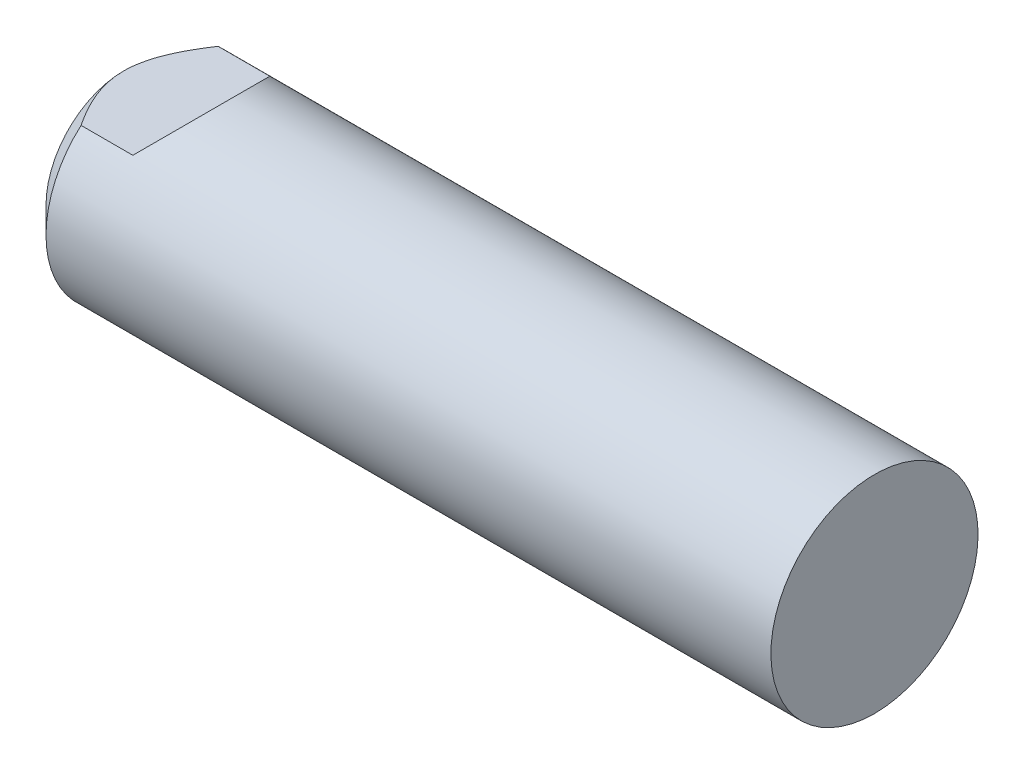
ISO-10303-21;
HEADER;
FILE_DESCRIPTION(('STEP AP214'),'2;1');
FILE_NAME('part.step','',(''),(''),'','','');
FILE_SCHEMA(('AUTOMOTIVE_DESIGN { 1 0 10303 214 1 1 1 1 }'));
ENDSEC;
DATA;
#1=APPLICATION_CONTEXT('core data for automotive mechanical design processes');
#2=APPLICATION_PROTOCOL_DEFINITION('international standard','automotive_design',2000,#1);
#3=PRODUCT_CONTEXT('',#1,'mechanical');
#4=PRODUCT('Part','Part','',(#3));
#5=PRODUCT_RELATED_PRODUCT_CATEGORY('part','',(#4));
#6=PRODUCT_DEFINITION_FORMATION('','',#4);
#7=PRODUCT_DEFINITION_CONTEXT('part definition',#1,'design');
#8=PRODUCT_DEFINITION('design','',#6,#7);
#9=PRODUCT_DEFINITION_SHAPE('','',#8);
#10=(LENGTH_UNIT() NAMED_UNIT(*) SI_UNIT(.MILLI.,.METRE.));
#11=(NAMED_UNIT(*) PLANE_ANGLE_UNIT() SI_UNIT($,.RADIAN.));
#12=(NAMED_UNIT(*) SI_UNIT($,.STERADIAN.) SOLID_ANGLE_UNIT());
#13=UNCERTAINTY_MEASURE_WITH_UNIT(LENGTH_MEASURE(1.E-05),#10,'distance_accuracy_value','');
#14=(GEOMETRIC_REPRESENTATION_CONTEXT(3) GLOBAL_UNCERTAINTY_ASSIGNED_CONTEXT((#13)) GLOBAL_UNIT_ASSIGNED_CONTEXT((#10,
#11,#12)) REPRESENTATION_CONTEXT('',''));
#15=CARTESIAN_POINT('',(0.,0.,0.));
#16=DIRECTION('',(0.,0.,1.));
#17=DIRECTION('',(1.,0.,0.));
#18=AXIS2_PLACEMENT_3D('',#15,#16,#17);
#19=CARTESIAN_POINT('',(-5.5,0.,0.));
#20=DIRECTION('',(-1.,0.,0.));
#21=DIRECTION('',(0.,0.,1.));
#22=AXIS2_PLACEMENT_3D('',#19,#20,#21);
#23=PLANE('',#22);
#24=CARTESIAN_POINT('',(-5.5,0.,0.));
#25=DIRECTION('',(1.,0.,0.));
#26=DIRECTION('',(0.,0.,-1.));
#27=AXIS2_PLACEMENT_3D('',#24,#25,#26);
#28=CIRCLE('',#27,3.);
#29=CARTESIAN_POINT('',(-5.5,3.,0.));
#30=VERTEX_POINT('',#29);
#31=CARTESIAN_POINT('',(-5.5,-3.,0.));
#32=VERTEX_POINT('',#31);
#33=EDGE_CURVE('E125',#30,#32,#28,.T.);
#34=ORIENTED_EDGE('',*,*,#33,.F.);
#35=EDGE_CURVE('E129',#32,#30,#28,.T.);
#36=ORIENTED_EDGE('',*,*,#35,.F.);
#37=EDGE_LOOP('',(#34,#36));
#38=FACE_BOUND('',#37,.T.);
#39=CARTESIAN_POINT('',(-5.5,0.,0.));
#40=DIRECTION('',(-1.,0.,0.));
#41=DIRECTION('',(0.,0.,1.));
#42=AXIS2_PLACEMENT_3D('',#39,#40,#41);
#43=CIRCLE('',#42,2.);
#44=CARTESIAN_POINT('',(-5.5,0.,2.));
#45=VERTEX_POINT('',#44);
#46=EDGE_CURVE('E189',#45,#45,#43,.T.);
#47=ORIENTED_EDGE('',*,*,#46,.F.);
#48=EDGE_LOOP('',(#47));
#49=FACE_BOUND('',#48,.T.);
#50=ADVANCED_FACE('F15',(#38,#49),#23,.T.);
#51=CARTESIAN_POINT('',(-5.5,0.,0.));
#52=DIRECTION('',(1.,0.,0.));
#53=DIRECTION('',(0.,-1.,0.));
#54=AXIS2_PLACEMENT_3D('',#51,#52,#53);
#55=CYLINDRICAL_SURFACE('',#54,4.);
#56=CARTESIAN_POINT('',(23.5,0.,0.));
#57=DIRECTION('',(-1.,0.,0.));
#58=DIRECTION('',(0.,-1.,0.));
#59=AXIS2_PLACEMENT_3D('',#56,#57,#58);
#60=CIRCLE('',#59,4.);
#61=CARTESIAN_POINT('',(23.5,-4.,0.));
#62=VERTEX_POINT('',#61);
#63=EDGE_CURVE('E112',#62,#62,#60,.T.);
#64=ORIENTED_EDGE('',*,*,#63,.T.);
#65=EDGE_LOOP('',(#64));
#66=FACE_BOUND('',#65,.T.);
#67=CARTESIAN_POINT('',(-5.5,0.,0.));
#68=DIRECTION('',(-0.707106781186548,-0.707106781186548,0.));
#69=DIRECTION('',(0.707106781186548,-0.707106781186548,0.));
#70=AXIS2_PLACEMENT_3D('',#67,#68,#69);
#71=ELLIPSE('',#70,5.65685424949238,4.);
#72=CARTESIAN_POINT('',(-2.5,-3.,2.64575131106459));
#73=VERTEX_POINT('',#72);
#74=CARTESIAN_POINT('',(-2.5,-3.,-2.64575131106459));
#75=VERTEX_POINT('',#74);
#76=EDGE_CURVE('E10',#73,#75,#71,.F.);
#77=ORIENTED_EDGE('',*,*,#76,.T.);
#78=DIRECTION('',(1.,0.,0.));
#79=VECTOR('',#78,1.);
#80=CARTESIAN_POINT('',(-5.5,-3.,-2.64575131106459));
#81=LINE('',#80,#79);
#82=CARTESIAN_POINT('',(-4.5,-3.,-2.64575131106459));
#83=VERTEX_POINT('',#82);
#84=EDGE_CURVE('E166',#75,#83,#81,.F.);
#85=ORIENTED_EDGE('',*,*,#84,.T.);
#86=CARTESIAN_POINT('',(-4.5,0.,0.));
#87=DIRECTION('',(1.,0.,0.));
#88=DIRECTION('',(0.,0.,-1.));
#89=AXIS2_PLACEMENT_3D('',#86,#87,#88);
#90=CIRCLE('',#89,4.);
#91=CARTESIAN_POINT('',(-4.5,3.,-2.64575131106459));
#92=VERTEX_POINT('',#91);
#93=EDGE_CURVE('E39',#83,#92,#90,.T.);
#94=ORIENTED_EDGE('',*,*,#93,.T.);
#95=DIRECTION('',(1.,0.,0.));
#96=VECTOR('',#95,1.);
#97=CARTESIAN_POINT('',(-5.5,3.,-2.64575131106459));
#98=LINE('',#97,#96);
#99=CARTESIAN_POINT('',(-2.5,3.,-2.64575131106459));
#100=VERTEX_POINT('',#99);
#101=EDGE_CURVE('E134',#92,#100,#98,.T.);
#102=ORIENTED_EDGE('',*,*,#101,.T.);
#103=CARTESIAN_POINT('',(-5.5,0.,0.));
#104=DIRECTION('',(-0.707106781186548,0.707106781186548,0.));
#105=DIRECTION('',(0.707106781186548,0.707106781186548,0.));
#106=AXIS2_PLACEMENT_3D('',#103,#104,#105);
#107=ELLIPSE('',#106,5.65685424949238,4.);
#108=CARTESIAN_POINT('',(-2.5,3.,2.64575131106459));
#109=VERTEX_POINT('',#108);
#110=EDGE_CURVE('E24',#100,#109,#107,.F.);
#111=ORIENTED_EDGE('',*,*,#110,.T.);
#112=DIRECTION('',(1.,0.,0.));
#113=VECTOR('',#112,1.);
#114=CARTESIAN_POINT('',(-5.5,3.,2.64575131106459));
#115=LINE('',#114,#113);
#116=CARTESIAN_POINT('',(-4.5,3.,2.64575131106459));
#117=VERTEX_POINT('',#116);
#118=EDGE_CURVE('E130',#109,#117,#115,.F.);
#119=ORIENTED_EDGE('',*,*,#118,.T.);
#120=CARTESIAN_POINT('',(-4.5,-3.,2.64575131106459));
#121=VERTEX_POINT('',#120);
#122=EDGE_CURVE('E114',#117,#121,#90,.T.);
#123=ORIENTED_EDGE('',*,*,#122,.T.);
#124=DIRECTION('',(1.,0.,0.));
#125=VECTOR('',#124,1.);
#126=CARTESIAN_POINT('',(-5.5,-3.,2.64575131106459));
#127=LINE('',#126,#125);
#128=EDGE_CURVE('E31',#121,#73,#127,.T.);
#129=ORIENTED_EDGE('',*,*,#128,.T.);
#130=EDGE_LOOP('',(#77,#85,#94,#102,#111,#119,#123,#129));
#131=FACE_BOUND('',#130,.T.);
#132=ADVANCED_FACE('F17',(#66,#131),#55,.T.);
#133=CARTESIAN_POINT('',(-4.5,0.,0.));
#134=DIRECTION('',(1.,0.,0.));
#135=DIRECTION('',(0.,0.,-1.));
#136=AXIS2_PLACEMENT_3D('',#133,#134,#135);
#137=CONICAL_SURFACE('',#136,4.,0.785398163397448);
#138=ORIENTED_EDGE('',*,*,#93,.F.);
#139=CARTESIAN_POINT('',(-1.94548054268565,-3.,-5.82766894360965));
#140=CARTESIAN_POINT('',(-2.06551170394384,-3.,-5.69264565157081));
#141=CARTESIAN_POINT('',(-2.18507706226616,-3.,-5.55720424751876));
#142=CARTESIAN_POINT('',(-2.42302671771593,-3.,-5.28526281263323));
#143=CARTESIAN_POINT('',(-2.54141088631035,-3.,-5.14876266940284));
#144=CARTESIAN_POINT('',(-2.77723936199561,-3.,-4.87390823263201));
#145=CARTESIAN_POINT('',(-2.89467725986058,-3.,-4.73554842944568));
#146=CARTESIAN_POINT('',(-3.12769999508739,-3.,-4.45728579803165));
#147=CARTESIAN_POINT('',(-3.24328492287716,-3.,-4.31738304566823));
#148=CARTESIAN_POINT('',(-3.47881295982103,-3.,-4.02739354649276));
#149=CARTESIAN_POINT('',(-3.59861383010706,-3.,-3.87719092138409));
#150=CARTESIAN_POINT('',(-3.8347159451542,-3.,-3.57406261021564));
#151=CARTESIAN_POINT('',(-3.95101741605343,-3.,-3.42113710113498));
#152=CARTESIAN_POINT('',(-4.17867048121916,-3.,-3.11204258371931));
#153=CARTESIAN_POINT('',(-4.29003042112843,-3.,-2.95587975274408));
#154=CARTESIAN_POINT('',(-4.5061129213864,-3.,-2.63905224451841));
#155=CARTESIAN_POINT('',(-4.61083789201158,-3.,-2.4783892329849));
#156=CARTESIAN_POINT('',(-4.78024812540257,-3.,-2.20105121720578));
#157=CARTESIAN_POINT('',(-4.84740797142381,-3.,-2.08589532077445));
#158=CARTESIAN_POINT('',(-4.97566018301428,-3.,-1.85216902016131));
#159=CARTESIAN_POINT('',(-5.03675066318814,-3.,-1.73359756963081));
#160=CARTESIAN_POINT('',(-5.15040846914627,-3.,-1.49359958600363));
#161=CARTESIAN_POINT('',(-5.20304246879999,-3.,-1.37220500859786));
#162=CARTESIAN_POINT('',(-5.29788029664392,-3.,-1.12539482874038));
#163=CARTESIAN_POINT('',(-5.34009071015928,-3.,-0.99998182189726));
#164=CARTESIAN_POINT('',(-5.40000142111435,-3.,-0.785495010123943));
#165=CARTESIAN_POINT('',(-5.42123449787262,-3.,-0.697409804346673));
#166=CARTESIAN_POINT('',(-5.4565422822498,-3.,-0.519807167805686));
#167=CARTESIAN_POINT('',(-5.47061822596404,-3.,-0.430289987112212));
#168=CARTESIAN_POINT('',(-5.49087054147825,-3.,-0.250605005368219));
#169=CARTESIAN_POINT('',(-5.49706868788015,-3.,-0.16043969350842));
#170=CARTESIAN_POINT('',(-5.50128995752322,-3.,0.0200867484575424));
#171=CARTESIAN_POINT('',(-5.49931298454878,-3.,0.11044788085587));
#172=CARTESIAN_POINT('',(-5.48730850745537,-3.,0.290452475938319));
#173=CARTESIAN_POINT('',(-5.47729628822314,-3.,0.380096975142597));
#174=CARTESIAN_POINT('',(-5.44977513282115,-3.,0.558232140307768));
#175=CARTESIAN_POINT('',(-5.43226439051643,-3.,0.646722522986975));
#176=CARTESIAN_POINT('',(-5.39048841082881,-3.,0.822421138374146));
#177=CARTESIAN_POINT('',(-5.36619833152721,-3.,0.909623389359968));
#178=CARTESIAN_POINT('',(-5.31183291607184,-3.,1.0821820501861));
#179=CARTESIAN_POINT('',(-5.28175761872002,-3.,1.16753847240226));
#180=CARTESIAN_POINT('',(-5.20665207620678,-3.,1.36255972060883));
#181=CARTESIAN_POINT('',(-5.15987705856534,-3.,1.47154946468094));
#182=CARTESIAN_POINT('',(-5.05976597336567,-3.,1.68649433196452));
#183=CARTESIAN_POINT('',(-5.0064265873109,-3.,1.79244788664334));
#184=CARTESIAN_POINT('',(-4.89453080451237,-3.,2.0018117219107));
#185=CARTESIAN_POINT('',(-4.83596429939984,-3.,2.1052165586568));
#186=CARTESIAN_POINT('',(-4.7148259575283,-3.,2.30961365298946));
#187=CARTESIAN_POINT('',(-4.65225477701282,-3.,2.41060630215392));
#188=CARTESIAN_POINT('',(-4.52301843284724,-3.,2.61197774335432));
#189=CARTESIAN_POINT('',(-4.45630744345493,-3.,2.71232698805909));
#190=CARTESIAN_POINT('',(-4.3202797197878,-3.,2.91124115726071));
#191=CARTESIAN_POINT('',(-4.25096290406063,-3.,3.00980602583901));
#192=CARTESIAN_POINT('',(-4.11031358241963,-3.,3.2053000837632));
#193=CARTESIAN_POINT('',(-4.03898364011754,-3.,3.30223112276299));
#194=CARTESIAN_POINT('',(-3.89461337833568,-3.,3.49480227644105));
#195=CARTESIAN_POINT('',(-3.82157312227523,-3.,3.59044243877903));
#196=CARTESIAN_POINT('',(-3.65986763368579,-3.,3.79894899514521));
#197=CARTESIAN_POINT('',(-3.57090369189213,-3.,3.91158345218856));
#198=CARTESIAN_POINT('',(-3.39134957432181,-3.,4.13555016737737));
#199=CARTESIAN_POINT('',(-3.30075935463072,-3.,4.24688239022407));
#200=CARTESIAN_POINT('',(-3.02698944146322,-3.,4.57927058312599));
#201=CARTESIAN_POINT('',(-2.8418288895786,-3.,4.79869462587684));
#202=CARTESIAN_POINT('',(-2.46779760857685,-3.,5.23449193466185));
#203=CARTESIAN_POINT('',(-2.27892542002672,-3.,5.45086394075902));
#204=CARTESIAN_POINT('',(-1.89853871647475,-3.,5.88127733851353));
#205=CARTESIAN_POINT('',(-1.7070241438539,-3.,6.09531867916644));
#206=CARTESIAN_POINT('',(-1.32165215176029,-3.,6.52204578607999));
#207=CARTESIAN_POINT('',(-1.12779085493927,-3.,6.73472804399719));
#208=CARTESIAN_POINT('',(-0.738554247137548,-3.,7.15870603720966));
#209=CARTESIAN_POINT('',(-0.543178916485926,-3.,7.37000175442436));
#210=CARTESIAN_POINT('',(0.0445989448417242,-3.,8.00215026496314));
#211=CARTESIAN_POINT('',(0.438752843689342,-3.,8.42137383523837));
#212=CARTESIAN_POINT('',(1.1833601136612,-3.,9.20767583521862));
#213=CARTESIAN_POINT('',(1.53348148688289,-3.,9.57506968487398));
#214=CARTESIAN_POINT('',(2.23542736122499,-3.,10.3082794985812));
#215=CARTESIAN_POINT('',(2.58725198884691,-3.,10.6740953414965));
#216=CARTESIAN_POINT('',(3.29094267040991,-3.,11.4033091898617));
#217=CARTESIAN_POINT('',(3.64280459006013,-3.,11.7667111889088));
#218=CARTESIAN_POINT('',(4.34744425994731,-3.,12.4925661629861));
#219=CARTESIAN_POINT('',(4.70022192942627,-3.,12.8550192163942));
#220=CARTESIAN_POINT('',(5.05333509686361,-3.,13.2171438763401));
#221=B_SPLINE_CURVE_WITH_KNOTS('',3,(#139,#140,#141,#142,#143,#144,#145,#146,#147,#148,#149,
#150,#151,#152,#153,#154,#155,#156,#157,#158,#159,#160,#161,#162,#163,#164,#165,#166,#167,#168,
#169,#170,#171,#172,#173,#174,#175,#176,#177,#178,#179,#180,#181,#182,#183,#184,#185,#186,#187,
#188,#189,#190,#191,#192,#193,#194,#195,#196,#197,#198,#199,#200,#201,#202,#203,#204,#205,#206,
#207,#208,#209,#210,#211,#212,#213,#214,#215,#216,#217,#218,#219,#220),.UNSPECIFIED.,.F.,.F.,(4,
2,2,2,2,2,2,2,2,2,2,2,2,2,2,2,2,2,2,2,2,2,2,2,2,2,2,2,2,2,2,2,2,2,2,2,2,2,2,2,4),(0.,
0.541989497215137,1.08403734239203,1.6284652492711,2.1728665058126,2.74921195485772,
3.32552007897709,3.90081464769182,4.47589901724458,4.87569159278173,5.27560797459713,
5.67219758195459,6.06853599056173,6.34010826464241,6.61163362002898,6.88240682272084,
7.15318321223911,7.42344574018985,7.69377340168778,7.96510494845332,8.23643467543848,
8.59195180149468,8.9476493967533,9.30405040632724,9.66039316149999,10.0218435300437,
10.3833052061333,10.7443256841433,11.1053327964577,11.5359059415807,11.9664907310284,
12.8277497007706,13.6893543801786,14.5509778772564,15.4143015886327,16.2776365355213,
18.0038627797185,19.5263781829708,21.0490084541535,22.566508062747,24.0838781081551),.UNSPECIFIED.);
#222=EDGE_CURVE('E162',#83,#32,#221,.T.);
#223=ORIENTED_EDGE('',*,*,#222,.T.);
#224=ORIENTED_EDGE('',*,*,#35,.T.);
#225=CARTESIAN_POINT('',(-1.94548054268565,3.,-5.82766894360965));
#226=CARTESIAN_POINT('',(-2.06551170394384,3.,-5.69264565157081));
#227=CARTESIAN_POINT('',(-2.18507706226616,3.,-5.55720424751876));
#228=CARTESIAN_POINT('',(-2.42302671771593,3.,-5.28526281263323));
#229=CARTESIAN_POINT('',(-2.54141088631035,3.,-5.14876266940284));
#230=CARTESIAN_POINT('',(-2.77723936199561,3.,-4.87390823263201));
#231=CARTESIAN_POINT('',(-2.89467725986058,3.,-4.73554842944568));
#232=CARTESIAN_POINT('',(-3.12769999508739,3.,-4.45728579803165));
#233=CARTESIAN_POINT('',(-3.24328492287716,3.,-4.31738304566823));
#234=CARTESIAN_POINT('',(-3.47881295982103,3.,-4.02739354649276));
#235=CARTESIAN_POINT('',(-3.59861383010706,3.,-3.87719092138409));
#236=CARTESIAN_POINT('',(-3.8347159451542,3.,-3.57406261021564));
#237=CARTESIAN_POINT('',(-3.95101741605343,3.,-3.42113710113498));
#238=CARTESIAN_POINT('',(-4.17867048121916,3.,-3.11204258371931));
#239=CARTESIAN_POINT('',(-4.29003042112843,3.,-2.95587975274408));
#240=CARTESIAN_POINT('',(-4.5061129213864,3.,-2.63905224451841));
#241=CARTESIAN_POINT('',(-4.61083789201158,3.,-2.4783892329849));
#242=CARTESIAN_POINT('',(-4.78024812540257,3.,-2.20105121720578));
#243=CARTESIAN_POINT('',(-4.84740797142381,3.,-2.08589532077445));
#244=CARTESIAN_POINT('',(-4.97566018301428,3.,-1.85216902016131));
#245=CARTESIAN_POINT('',(-5.03675066318814,3.,-1.73359756963081));
#246=CARTESIAN_POINT('',(-5.15040846914627,3.,-1.49359958600363));
#247=CARTESIAN_POINT('',(-5.20304246879999,3.,-1.37220500859786));
#248=CARTESIAN_POINT('',(-5.29788029664392,3.,-1.12539482874038));
#249=CARTESIAN_POINT('',(-5.34009071015928,3.,-0.99998182189726));
#250=CARTESIAN_POINT('',(-5.40000142111435,3.,-0.785495010123943));
#251=CARTESIAN_POINT('',(-5.42123449787262,3.,-0.697409804346673));
#252=CARTESIAN_POINT('',(-5.4565422822498,3.,-0.519807167805686));
#253=CARTESIAN_POINT('',(-5.47061822596404,3.,-0.430289987112212));
#254=CARTESIAN_POINT('',(-5.49087054147825,3.,-0.250605005368219));
#255=CARTESIAN_POINT('',(-5.49706868788014,3.,-0.160439693508419));
#256=CARTESIAN_POINT('',(-5.50128995752322,3.,0.0200867484575424));
#257=CARTESIAN_POINT('',(-5.49931298454878,3.,0.11044788085587));
#258=CARTESIAN_POINT('',(-5.48730850745537,3.,0.290452475938319));
#259=CARTESIAN_POINT('',(-5.47729628822314,3.,0.380096975142597));
#260=CARTESIAN_POINT('',(-5.44977513282115,3.,0.558232140307768));
#261=CARTESIAN_POINT('',(-5.43226439051643,3.,0.646722522986975));
#262=CARTESIAN_POINT('',(-5.39048841082881,3.,0.822421138374146));
#263=CARTESIAN_POINT('',(-5.36619833152721,3.,0.909623389359967));
#264=CARTESIAN_POINT('',(-5.31183291607184,3.,1.0821820501861));
#265=CARTESIAN_POINT('',(-5.28175761872002,3.,1.16753847240226));
#266=CARTESIAN_POINT('',(-5.20665207620678,3.,1.36255972060883));
#267=CARTESIAN_POINT('',(-5.15987705856534,3.,1.47154946468094));
#268=CARTESIAN_POINT('',(-5.05976597336567,3.,1.68649433196452));
#269=CARTESIAN_POINT('',(-5.0064265873109,3.,1.79244788664334));
#270=CARTESIAN_POINT('',(-4.89453080451237,3.,2.0018117219107));
#271=CARTESIAN_POINT('',(-4.83596429939984,3.,2.1052165586568));
#272=CARTESIAN_POINT('',(-4.7148259575283,3.,2.30961365298946));
#273=CARTESIAN_POINT('',(-4.65225477701282,3.,2.41060630215392));
#274=CARTESIAN_POINT('',(-4.52301843284723,3.,2.61197774335432));
#275=CARTESIAN_POINT('',(-4.45630744345492,3.,2.71232698805909));
#276=CARTESIAN_POINT('',(-4.3202797197878,3.,2.91124115726071));
#277=CARTESIAN_POINT('',(-4.25096290406063,3.,3.00980602583901));
#278=CARTESIAN_POINT('',(-4.11031358241963,3.,3.2053000837632));
#279=CARTESIAN_POINT('',(-4.03898364011754,3.,3.302231122763));
#280=CARTESIAN_POINT('',(-3.89461337833567,3.,3.49480227644105));
#281=CARTESIAN_POINT('',(-3.82157312227523,3.,3.59044243877903));
#282=CARTESIAN_POINT('',(-3.65986763368579,3.,3.79894899514521));
#283=CARTESIAN_POINT('',(-3.57090369189213,3.,3.91158345218856));
#284=CARTESIAN_POINT('',(-3.39134957432181,3.,4.13555016737737));
#285=CARTESIAN_POINT('',(-3.30075935463072,3.,4.24688239022408));
#286=CARTESIAN_POINT('',(-3.02698944146322,3.,4.579270583126));
#287=CARTESIAN_POINT('',(-2.84182888957859,3.,4.79869462587685));
#288=CARTESIAN_POINT('',(-2.46779760857685,3.,5.23449193466185));
#289=CARTESIAN_POINT('',(-2.27892542002672,3.,5.45086394075903));
#290=CARTESIAN_POINT('',(-1.89853871647474,3.,5.88127733851354));
#291=CARTESIAN_POINT('',(-1.7070241438539,3.,6.09531867916645));
#292=CARTESIAN_POINT('',(-1.32165215176028,3.,6.52204578608));
#293=CARTESIAN_POINT('',(-1.12779085493926,3.,6.7347280439972));
#294=CARTESIAN_POINT('',(-0.738554247137539,3.,7.15870603720967));
#295=CARTESIAN_POINT('',(-0.543178916485917,3.,7.37000175442437));
#296=CARTESIAN_POINT('',(0.0445989448417344,3.,8.00215026496315));
#297=CARTESIAN_POINT('',(0.438752843689354,3.,8.42137383523838));
#298=CARTESIAN_POINT('',(1.18336011366122,3.,9.20767583521863));
#299=CARTESIAN_POINT('',(1.5334814868829,3.,9.57506968487399));
#300=CARTESIAN_POINT('',(2.235427361225,3.,10.3082794985813));
#301=CARTESIAN_POINT('',(2.58725198884692,3.,10.6740953414965));
#302=CARTESIAN_POINT('',(3.29094267040992,3.,11.4033091898617));
#303=CARTESIAN_POINT('',(3.64280459006014,3.,11.7667111889088));
#304=CARTESIAN_POINT('',(4.34744425994731,3.,12.4925661629861));
#305=CARTESIAN_POINT('',(4.70022192942628,3.,12.8550192163942));
#306=CARTESIAN_POINT('',(5.05333509686362,3.,13.2171438763401));
#307=B_SPLINE_CURVE_WITH_KNOTS('',3,(#225,#226,#227,#228,#229,#230,#231,#232,#233,#234,#235,
#236,#237,#238,#239,#240,#241,#242,#243,#244,#245,#246,#247,#248,#249,#250,#251,#252,#253,#254,
#255,#256,#257,#258,#259,#260,#261,#262,#263,#264,#265,#266,#267,#268,#269,#270,#271,#272,#273,
#274,#275,#276,#277,#278,#279,#280,#281,#282,#283,#284,#285,#286,#287,#288,#289,#290,#291,#292,
#293,#294,#295,#296,#297,#298,#299,#300,#301,#302,#303,#304,#305,#306),.UNSPECIFIED.,.F.,.F.,(4,
2,2,2,2,2,2,2,2,2,2,2,2,2,2,2,2,2,2,2,2,2,2,2,2,2,2,2,2,2,2,2,2,2,2,2,2,2,2,2,4),(0.,
0.541989497215137,1.08403734239203,1.6284652492711,2.1728665058126,2.74921195485772,
3.32552007897709,3.90081464769182,4.47589901724458,4.87569159278173,5.27560797459713,
5.67219758195459,6.06853599056173,6.34010826464241,6.61163362002898,6.88240682272084,
7.15318321223911,7.42344574018985,7.69377340168778,7.96510494845332,8.23643467543848,
8.59195180149468,8.9476493967533,9.30405040632725,9.66039316149999,10.0218435300437,
10.3833052061333,10.7443256841433,11.1053327964577,11.5359059415807,11.9664907310284,
12.8277497007706,13.6893543801786,14.5509778772564,15.4143015886327,16.2776365355214,
18.0038627797185,19.5263781829708,21.0490084541535,22.566508062747,24.0838781081551),.UNSPECIFIED.);
#308=EDGE_CURVE('E138',#30,#92,#307,.F.);
#309=ORIENTED_EDGE('',*,*,#308,.T.);
#310=EDGE_LOOP('',(#138,#223,#224,#309));
#311=FACE_BOUND('',#310,.T.);
#312=ADVANCED_FACE('F91',(#311),#137,.T.);
#313=ORIENTED_EDGE('',*,*,#33,.T.);
#314=EDGE_CURVE('E155',#32,#121,#221,.T.);
#315=ORIENTED_EDGE('',*,*,#314,.T.);
#316=ORIENTED_EDGE('',*,*,#122,.F.);
#317=EDGE_CURVE('E137',#117,#30,#307,.F.);
#318=ORIENTED_EDGE('',*,*,#317,.T.);
#319=EDGE_LOOP('',(#313,#315,#316,#318));
#320=FACE_BOUND('',#319,.T.);
#321=ADVANCED_FACE('F101',(#320),#137,.T.);
#322=CARTESIAN_POINT('',(23.5,0.,0.));
#323=DIRECTION('',(1.,0.,0.));
#324=DIRECTION('',(0.,0.,-1.));
#325=AXIS2_PLACEMENT_3D('',#322,#323,#324);
#326=PLANE('',#325);
#327=ORIENTED_EDGE('',*,*,#63,.F.);
#328=EDGE_LOOP('',(#327));
#329=FACE_BOUND('',#328,.T.);
#330=ADVANCED_FACE('F98',(#329),#326,.T.);
#331=CARTESIAN_POINT('',(-6.5,3.,4.));
#332=DIRECTION('',(0.,1.,0.));
#333=DIRECTION('',(0.,0.,1.));
#334=AXIS2_PLACEMENT_3D('',#331,#332,#333);
#335=PLANE('',#334);
#336=DIRECTION('',(0.,0.,-1.));
#337=VECTOR('',#336,1.);
#338=CARTESIAN_POINT('',(-2.5,3.,4.));
#339=LINE('',#338,#337);
#340=EDGE_CURVE('E145',#109,#100,#339,.T.);
#341=ORIENTED_EDGE('',*,*,#340,.T.);
#342=ORIENTED_EDGE('',*,*,#101,.F.);
#343=ORIENTED_EDGE('',*,*,#308,.F.);
#344=ORIENTED_EDGE('',*,*,#317,.F.);
#345=ORIENTED_EDGE('',*,*,#118,.F.);
#346=EDGE_LOOP('',(#341,#342,#343,#344,#345));
#347=FACE_BOUND('',#346,.T.);
#348=ADVANCED_FACE('F100',(#347),#335,.T.);
#349=CARTESIAN_POINT('',(-2.5,3.,4.));
#350=DIRECTION('',(-0.707106781186548,0.707106781186548,0.));
#351=DIRECTION('',(-0.707106781186548,-0.707106781186548,0.));
#352=AXIS2_PLACEMENT_3D('',#349,#350,#351);
#353=PLANE('',#352);
#354=ORIENTED_EDGE('',*,*,#340,.F.);
#355=ORIENTED_EDGE('',*,*,#110,.F.);
#356=EDGE_LOOP('',(#354,#355));
#357=FACE_BOUND('',#356,.T.);
#358=ADVANCED_FACE('F107',(#357),#353,.T.);
#359=CARTESIAN_POINT('',(-6.5,-3.,-4.));
#360=DIRECTION('',(0.,-1.,0.));
#361=DIRECTION('',(0.,0.,-1.));
#362=AXIS2_PLACEMENT_3D('',#359,#360,#361);
#363=PLANE('',#362);
#364=DIRECTION('',(0.,0.,1.));
#365=VECTOR('',#364,1.);
#366=CARTESIAN_POINT('',(-2.5,-3.,-4.));
#367=LINE('',#366,#365);
#368=EDGE_CURVE('E163',#75,#73,#367,.T.);
#369=ORIENTED_EDGE('',*,*,#368,.T.);
#370=ORIENTED_EDGE('',*,*,#128,.F.);
#371=ORIENTED_EDGE('',*,*,#314,.F.);
#372=ORIENTED_EDGE('',*,*,#222,.F.);
#373=ORIENTED_EDGE('',*,*,#84,.F.);
#374=EDGE_LOOP('',(#369,#370,#371,#372,#373));
#375=FACE_BOUND('',#374,.T.);
#376=ADVANCED_FACE('F81',(#375),#363,.T.);
#377=CARTESIAN_POINT('',(-2.5,-3.,-4.));
#378=DIRECTION('',(-0.707106781186548,-0.707106781186548,0.));
#379=DIRECTION('',(-0.707106781186548,0.707106781186548,0.));
#380=AXIS2_PLACEMENT_3D('',#377,#378,#379);
#381=PLANE('',#380);
#382=ORIENTED_EDGE('',*,*,#368,.F.);
#383=ORIENTED_EDGE('',*,*,#76,.F.);
#384=EDGE_LOOP('',(#382,#383));
#385=FACE_BOUND('',#384,.T.);
#386=ADVANCED_FACE('F70',(#385),#381,.T.);
#387=CARTESIAN_POINT('',(5.43595695514003,0.,0.));
#388=DIRECTION('',(-1.,0.,0.));
#389=DIRECTION('',(0.,0.,1.));
#390=AXIS2_PLACEMENT_3D('',#387,#388,#389);
#391=CONICAL_SURFACE('',#390,0.,1.0471975511966);
#392=CARTESIAN_POINT('',(4.5,0.,0.));
#393=DIRECTION('',(-1.,0.,0.));
#394=DIRECTION('',(0.,0.,1.));
#395=AXIS2_PLACEMENT_3D('',#392,#393,#394);
#396=CIRCLE('',#395,1.621125);
#397=CARTESIAN_POINT('',(4.5,0.,1.621125));
#398=VERTEX_POINT('',#397);
#399=EDGE_CURVE('E211',#398,#398,#396,.T.);
#400=ORIENTED_EDGE('',*,*,#399,.T.);
#401=EDGE_LOOP('',(#400));
#402=FACE_BOUND('',#401,.T.);
#403=CARTESIAN_POINT('',(5.43595695514003,0.,0.));
#404=VERTEX_POINT('',#403);
#405=VERTEX_LOOP('',#404);
#406=FACE_BOUND('',#405,.T.);
#407=ADVANCED_FACE('F67',(#402,#406),#391,.F.);
#408=CARTESIAN_POINT('',(-6.5,0.,0.));
#409=DIRECTION('',(-1.,0.,0.));
#410=DIRECTION('',(0.,0.,1.));
#411=AXIS2_PLACEMENT_3D('',#408,#409,#410);
#412=CYLINDRICAL_SURFACE('',#411,1.621125);
#413=CARTESIAN_POINT('',(2.878875,0.,0.));
#414=DIRECTION('',(-1.,0.,0.));
#415=DIRECTION('',(0.,0.,1.));
#416=AXIS2_PLACEMENT_3D('',#413,#414,#415);
#417=CIRCLE('',#416,1.621125);
#418=CARTESIAN_POINT('',(2.878875,0.,1.621125));
#419=VERTEX_POINT('',#418);
#420=EDGE_CURVE('E208',#419,#419,#417,.T.);
#421=ORIENTED_EDGE('',*,*,#420,.T.);
#422=EDGE_LOOP('',(#421));
#423=FACE_BOUND('',#422,.T.);
#424=ORIENTED_EDGE('',*,*,#399,.F.);
#425=EDGE_LOOP('',(#424));
#426=FACE_BOUND('',#425,.T.);
#427=ADVANCED_FACE('F69',(#423,#426),#412,.F.);
#428=CARTESIAN_POINT('',(2.878875,0.,0.));
#429=DIRECTION('',(-1.,0.,0.));
#430=DIRECTION('',(0.,0.,1.));
#431=AXIS2_PLACEMENT_3D('',#428,#429,#430);
#432=CONICAL_SURFACE('',#431,1.621125,0.785398163397448);
#433=CARTESIAN_POINT('',(2.5,0.,0.));
#434=DIRECTION('',(-1.,0.,0.));
#435=DIRECTION('',(0.,0.,1.));
#436=AXIS2_PLACEMENT_3D('',#433,#434,#435);
#437=CIRCLE('',#436,2.);
#438=CARTESIAN_POINT('',(2.5,0.,2.));
#439=VERTEX_POINT('',#438);
#440=EDGE_CURVE('E204',#439,#439,#437,.T.);
#441=ORIENTED_EDGE('',*,*,#440,.T.);
#442=EDGE_LOOP('',(#441));
#443=FACE_BOUND('',#442,.T.);
#444=ORIENTED_EDGE('',*,*,#420,.F.);
#445=EDGE_LOOP('',(#444));
#446=FACE_BOUND('',#445,.T.);
#447=ADVANCED_FACE('F78',(#443,#446),#432,.F.);
#448=CARTESIAN_POINT('',(2.5,2.,0.));
#449=DIRECTION('',(1.,0.,0.));
#450=DIRECTION('',(0.,0.,-1.));
#451=AXIS2_PLACEMENT_3D('',#448,#449,#450);
#452=PLANE('',#451);
#453=CARTESIAN_POINT('',(2.5,0.,0.));
#454=DIRECTION('',(-1.,0.,0.));
#455=DIRECTION('',(0.,0.,1.));
#456=AXIS2_PLACEMENT_3D('',#453,#454,#455);
#457=CIRCLE('',#456,1.621125);
#458=CARTESIAN_POINT('',(2.5,0.,1.621125));
#459=VERTEX_POINT('',#458);
#460=EDGE_CURVE('E198',#459,#459,#457,.T.);
#461=ORIENTED_EDGE('',*,*,#460,.T.);
#462=EDGE_LOOP('',(#461));
#463=FACE_BOUND('',#462,.T.);
#464=ORIENTED_EDGE('',*,*,#440,.F.);
#465=EDGE_LOOP('',(#464));
#466=FACE_BOUND('',#465,.T.);
#467=ADVANCED_FACE('F225',(#463,#466),#452,.T.);
#468=CARTESIAN_POINT('',(-6.5,0.,0.));
#469=DIRECTION('',(-1.,0.,0.));
#470=DIRECTION('',(0.,0.,1.));
#471=AXIS2_PLACEMENT_3D('',#468,#469,#470);
#472=CYLINDRICAL_SURFACE('',#471,1.621125);
#473=CARTESIAN_POINT('',(-5.121125,0.,0.));
#474=DIRECTION('',(-1.,0.,0.));
#475=DIRECTION('',(0.,0.,1.));
#476=AXIS2_PLACEMENT_3D('',#473,#474,#475);
#477=CIRCLE('',#476,1.621125);
#478=CARTESIAN_POINT('',(-5.121125,0.,1.621125));
#479=VERTEX_POINT('',#478);
#480=EDGE_CURVE('E192',#479,#479,#477,.T.);
#481=ORIENTED_EDGE('',*,*,#480,.T.);
#482=EDGE_LOOP('',(#481));
#483=FACE_BOUND('',#482,.T.);
#484=ORIENTED_EDGE('',*,*,#460,.F.);
#485=EDGE_LOOP('',(#484));
#486=FACE_BOUND('',#485,.T.);
#487=ADVANCED_FACE('F231',(#483,#486),#472,.F.);
#488=CARTESIAN_POINT('',(-5.121125,0.,0.));
#489=DIRECTION('',(-1.,0.,0.));
#490=DIRECTION('',(0.,0.,1.));
#491=AXIS2_PLACEMENT_3D('',#488,#489,#490);
#492=CONICAL_SURFACE('',#491,1.621125,0.785398163397448);
#493=ORIENTED_EDGE('',*,*,#46,.T.);
#494=EDGE_LOOP('',(#493));
#495=FACE_BOUND('',#494,.T.);
#496=ORIENTED_EDGE('',*,*,#480,.F.);
#497=EDGE_LOOP('',(#496));
#498=FACE_BOUND('',#497,.T.);
#499=ADVANCED_FACE('F237',(#495,#498),#492,.F.);
#500=CLOSED_SHELL('',(#50,#132,#312,#321,#330,#348,#358,#376,#386,#407,#427,#447,#467,#487,#499));
#501=MANIFOLD_SOLID_BREP('B1',#500);
#502=ADVANCED_BREP_SHAPE_REPRESENTATION('',(#18,#501),#14);
#503=SHAPE_DEFINITION_REPRESENTATION(#9,#502);
ENDSEC;
END-ISO-10303-21;
